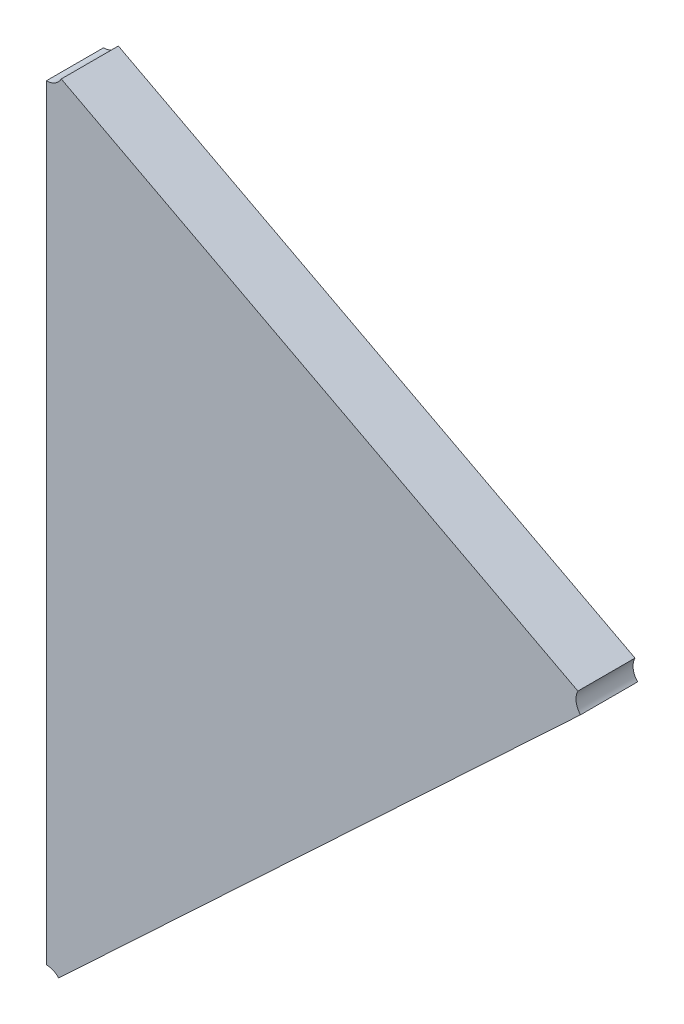
ISO-10303-21;
HEADER;
FILE_DESCRIPTION(('STEP AP214'),'2;1');
FILE_NAME('part.step','',(''),(''),'','','');
FILE_SCHEMA(('AUTOMOTIVE_DESIGN { 1 0 10303 214 1 1 1 1 }'));
ENDSEC;
DATA;
#1=APPLICATION_CONTEXT('core data for automotive mechanical design processes');
#2=APPLICATION_PROTOCOL_DEFINITION('international standard','automotive_design',2000,#1);
#3=PRODUCT_CONTEXT('',#1,'mechanical');
#4=PRODUCT('Part','Part','',(#3));
#5=PRODUCT_RELATED_PRODUCT_CATEGORY('part','',(#4));
#6=PRODUCT_DEFINITION_FORMATION('','',#4);
#7=PRODUCT_DEFINITION_CONTEXT('part definition',#1,'design');
#8=PRODUCT_DEFINITION('design','',#6,#7);
#9=PRODUCT_DEFINITION_SHAPE('','',#8);
#10=(LENGTH_UNIT() NAMED_UNIT(*) SI_UNIT(.MILLI.,.METRE.));
#11=(NAMED_UNIT(*) PLANE_ANGLE_UNIT() SI_UNIT($,.RADIAN.));
#12=(NAMED_UNIT(*) SI_UNIT($,.STERADIAN.) SOLID_ANGLE_UNIT());
#13=UNCERTAINTY_MEASURE_WITH_UNIT(LENGTH_MEASURE(1.E-05),#10,'distance_accuracy_value','');
#14=(GEOMETRIC_REPRESENTATION_CONTEXT(3) GLOBAL_UNCERTAINTY_ASSIGNED_CONTEXT((#13)) GLOBAL_UNIT_ASSIGNED_CONTEXT((#10,
#11,#12)) REPRESENTATION_CONTEXT('',''));
#15=CARTESIAN_POINT('',(0.,0.,0.));
#16=DIRECTION('',(0.,0.,1.));
#17=DIRECTION('',(1.,0.,0.));
#18=AXIS2_PLACEMENT_3D('',#15,#16,#17);
#19=CARTESIAN_POINT('',(-1.36524682085775,-1.28570071400538,0.0042));
#20=DIRECTION('',(0.,0.,1.));
#21=DIRECTION('',(1.,0.,0.));
#22=AXIS2_PLACEMENT_3D('',#19,#20,#21);
#23=PLANE('',#22);
#24=CARTESIAN_POINT('',(-1.37552796514819,-1.31090066755203,0.0042));
#25=DIRECTION('',(0.,0.,-1.));
#26=DIRECTION('',(0.,1.,0.));
#27=AXIS2_PLACEMENT_3D('',#24,#25,#26);
#28=CIRCLE('',#27,0.000999999999999994);
#29=CARTESIAN_POINT('',(-1.37552796514819,-1.30990066755203,0.0042));
#30=VERTEX_POINT('',#29);
#31=CARTESIAN_POINT('',(-1.37479814330141,-1.31021703016864,0.0042));
#32=VERTEX_POINT('',#31);
#33=EDGE_CURVE('E11',#30,#32,#28,.T.);
#34=ORIENTED_EDGE('',*,*,#33,.T.);
#35=DIRECTION('',(0.729821846781321,0.683637383384424,0.));
#36=VECTOR('',#35,1.);
#37=CARTESIAN_POINT('',(-1.37479814330141,-1.31021703016864,0.0042));
#38=LINE('',#37,#36);
#39=CARTESIAN_POINT('',(-1.34372317874952,-1.28110854629863,0.0042));
#40=VERTEX_POINT('',#39);
#41=EDGE_CURVE('E113',#32,#40,#38,.T.);
#42=ORIENTED_EDGE('',*,*,#41,.T.);
#43=CARTESIAN_POINT('',(-1.34299335690274,-1.28042490891524,0.0042));
#44=DIRECTION('',(0.,0.,-1.));
#45=DIRECTION('',(-0.72982184677793,-0.683637383388044,0.));
#46=AXIS2_PLACEMENT_3D('',#43,#44,#45);
#47=CIRCLE('',#46,0.00100000000000001);
#48=CARTESIAN_POINT('',(-1.34387839637048,-1.27995939292138,0.0042));
#49=VERTEX_POINT('',#48);
#50=EDGE_CURVE('E107',#40,#49,#47,.T.);
#51=ORIENTED_EDGE('',*,*,#50,.T.);
#52=DIRECTION('',(-0.88503946773786,0.465515993867328,0.));
#53=VECTOR('',#52,1.);
#54=CARTESIAN_POINT('',(-1.34387839637048,-1.27995939292138,0.0042));
#55=LINE('',#54,#53);
#56=CARTESIAN_POINT('',(-1.37464292568045,-1.26377776378545,0.0042));
#57=VERTEX_POINT('',#56);
#58=EDGE_CURVE('E70',#49,#57,#55,.T.);
#59=ORIENTED_EDGE('',*,*,#58,.T.);
#60=CARTESIAN_POINT('',(-1.37552796514819,-1.26331224779158,0.0042));
#61=DIRECTION('',(0.,0.,-1.));
#62=DIRECTION('',(0.885039467737278,-0.465515993868434,0.));
#63=AXIS2_PLACEMENT_3D('',#60,#61,#62);
#64=CIRCLE('',#63,0.00100000000000001);
#65=CARTESIAN_POINT('',(-1.37552796514819,-1.26431224779158,0.0042));
#66=VERTEX_POINT('',#65);
#67=EDGE_CURVE('E66',#57,#66,#64,.T.);
#68=ORIENTED_EDGE('',*,*,#67,.T.);
#69=DIRECTION('',(0.,-1.,0.));
#70=VECTOR('',#69,1.);
#71=CARTESIAN_POINT('',(-1.37552796514819,-1.26431224779158,0.0042));
#72=LINE('',#71,#70);
#73=EDGE_CURVE('E68',#66,#30,#72,.T.);
#74=ORIENTED_EDGE('',*,*,#73,.T.);
#75=EDGE_LOOP('',(#34,#42,#51,#59,#68,#74));
#76=FACE_BOUND('',#75,.T.);
#77=ADVANCED_FACE('F17',(#76),#23,.T.);
#78=CARTESIAN_POINT('',(-1.3652650664721,-1.28572023478097,0.0008));
#79=DIRECTION('',(0.,0.,-1.));
#80=DIRECTION('',(-1.,0.,0.));
#81=AXIS2_PLACEMENT_3D('',#78,#79,#80);
#82=PLANE('',#81);
#83=CARTESIAN_POINT('',(-1.37552796514819,-1.31090066755203,0.0008));
#84=DIRECTION('',(0.,0.,1.));
#85=DIRECTION('',(0.72982184677793,0.683637383388044,0.));
#86=AXIS2_PLACEMENT_3D('',#83,#84,#85);
#87=CIRCLE('',#86,0.000999999999999994);
#88=CARTESIAN_POINT('',(-1.37479814330141,-1.31021703016864,0.0008));
#89=VERTEX_POINT('',#88);
#90=CARTESIAN_POINT('',(-1.37552796514819,-1.30990066755203,0.0008));
#91=VERTEX_POINT('',#90);
#92=EDGE_CURVE('E24',#89,#91,#87,.T.);
#93=ORIENTED_EDGE('',*,*,#92,.T.);
#94=DIRECTION('',(0.,1.,0.));
#95=VECTOR('',#94,1.);
#96=CARTESIAN_POINT('',(-1.37552796514819,-1.30990066755203,0.0008));
#97=LINE('',#96,#95);
#98=CARTESIAN_POINT('',(-1.37552796514819,-1.26431224779158,0.0008));
#99=VERTEX_POINT('',#98);
#100=EDGE_CURVE('E109',#91,#99,#97,.T.);
#101=ORIENTED_EDGE('',*,*,#100,.T.);
#102=CARTESIAN_POINT('',(-1.37552796514819,-1.26331224779158,0.0008));
#103=DIRECTION('',(0.,0.,1.));
#104=DIRECTION('',(0.,-1.,0.));
#105=AXIS2_PLACEMENT_3D('',#102,#103,#104);
#106=CIRCLE('',#105,0.00100000000000001);
#107=CARTESIAN_POINT('',(-1.37464292568045,-1.26377776378545,0.0008));
#108=VERTEX_POINT('',#107);
#109=EDGE_CURVE('E88',#99,#108,#106,.T.);
#110=ORIENTED_EDGE('',*,*,#109,.T.);
#111=DIRECTION('',(0.885039467737862,-0.465515993867323,0.));
#112=VECTOR('',#111,1.);
#113=CARTESIAN_POINT('',(-1.37464292568045,-1.26377776378545,0.0008));
#114=LINE('',#113,#112);
#115=CARTESIAN_POINT('',(-1.34387839637048,-1.27995939292138,0.0008));
#116=VERTEX_POINT('',#115);
#117=EDGE_CURVE('E102',#108,#116,#114,.T.);
#118=ORIENTED_EDGE('',*,*,#117,.T.);
#119=CARTESIAN_POINT('',(-1.34299335690274,-1.28042490891524,0.0008));
#120=DIRECTION('',(0.,0.,1.));
#121=DIRECTION('',(-0.885039467741346,0.4655159938607,0.));
#122=AXIS2_PLACEMENT_3D('',#119,#120,#121);
#123=CIRCLE('',#122,0.00100000000000001);
#124=CARTESIAN_POINT('',(-1.34372317874952,-1.28110854629863,0.0008));
#125=VERTEX_POINT('',#124);
#126=EDGE_CURVE('E89',#116,#125,#123,.T.);
#127=ORIENTED_EDGE('',*,*,#126,.T.);
#128=DIRECTION('',(-0.729821846781323,-0.683637383384422,0.));
#129=VECTOR('',#128,1.);
#130=CARTESIAN_POINT('',(-1.34372317874952,-1.28110854629863,0.0008));
#131=LINE('',#130,#129);
#132=EDGE_CURVE('E97',#125,#89,#131,.T.);
#133=ORIENTED_EDGE('',*,*,#132,.T.);
#134=EDGE_LOOP('',(#93,#101,#110,#118,#127,#133));
#135=FACE_BOUND('',#134,.T.);
#136=ADVANCED_FACE('F125',(#135),#82,.T.);
#137=CARTESIAN_POINT('',(-1.37552796514819,-1.26331224779158,0.0008));
#138=DIRECTION('',(-0.465515993867324,-0.885039467737862,0.));
#139=DIRECTION('',(0.885039467737862,-0.465515993867324,0.));
#140=AXIS2_PLACEMENT_3D('',#137,#138,#139);
#141=PLANE('',#140);
#142=DIRECTION('',(0.,0.,-1.));
#143=VECTOR('',#142,1.);
#144=CARTESIAN_POINT('',(-1.34387839637048,-1.27995939292138,0.0042));
#145=LINE('',#144,#143);
#146=EDGE_CURVE('E111',#49,#116,#145,.T.);
#147=ORIENTED_EDGE('',*,*,#146,.T.);
#148=ORIENTED_EDGE('',*,*,#117,.F.);
#149=DIRECTION('',(0.,0.,1.));
#150=VECTOR('',#149,1.);
#151=CARTESIAN_POINT('',(-1.37464292568045,-1.26377776378545,0.0008));
#152=LINE('',#151,#150);
#153=EDGE_CURVE('E75',#108,#57,#152,.T.);
#154=ORIENTED_EDGE('',*,*,#153,.T.);
#155=ORIENTED_EDGE('',*,*,#58,.F.);
#156=EDGE_LOOP('',(#147,#148,#154,#155));
#157=FACE_BOUND('',#156,.T.);
#158=ADVANCED_FACE('F124',(#157),#141,.F.);
#159=CARTESIAN_POINT('',(-1.34299335690274,-1.28042490891524,0.0008));
#160=DIRECTION('',(-0.683637383384425,0.729821846781321,0.));
#161=DIRECTION('',(-0.729821846781321,-0.683637383384425,0.));
#162=AXIS2_PLACEMENT_3D('',#159,#160,#161);
#163=PLANE('',#162);
#164=DIRECTION('',(0.,0.,-1.));
#165=VECTOR('',#164,1.);
#166=CARTESIAN_POINT('',(-1.37479814330141,-1.31021703016864,0.0042));
#167=LINE('',#166,#165);
#168=EDGE_CURVE('E105',#32,#89,#167,.T.);
#169=ORIENTED_EDGE('',*,*,#168,.T.);
#170=ORIENTED_EDGE('',*,*,#132,.F.);
#171=DIRECTION('',(0.,0.,1.));
#172=VECTOR('',#171,1.);
#173=CARTESIAN_POINT('',(-1.34372317874952,-1.28110854629863,0.0008));
#174=LINE('',#173,#172);
#175=EDGE_CURVE('E83',#125,#40,#174,.T.);
#176=ORIENTED_EDGE('',*,*,#175,.T.);
#177=ORIENTED_EDGE('',*,*,#41,.F.);
#178=EDGE_LOOP('',(#169,#170,#176,#177));
#179=FACE_BOUND('',#178,.T.);
#180=ADVANCED_FACE('F118',(#179),#163,.F.);
#181=CARTESIAN_POINT('',(-1.37552796514819,-1.31090066755203,0.0008));
#182=DIRECTION('',(1.,0.,0.));
#183=DIRECTION('',(0.,1.,0.));
#184=AXIS2_PLACEMENT_3D('',#181,#182,#183);
#185=PLANE('',#184);
#186=DIRECTION('',(0.,0.,1.));
#187=VECTOR('',#186,1.);
#188=CARTESIAN_POINT('',(-1.37552796514819,-1.30990066755203,0.0008));
#189=LINE('',#188,#187);
#190=EDGE_CURVE('E82',#91,#30,#189,.T.);
#191=ORIENTED_EDGE('',*,*,#190,.T.);
#192=ORIENTED_EDGE('',*,*,#73,.F.);
#193=DIRECTION('',(0.,0.,1.));
#194=VECTOR('',#193,1.);
#195=CARTESIAN_POINT('',(-1.37552796514819,-1.26431224779158,0.0008));
#196=LINE('',#195,#194);
#197=EDGE_CURVE('E80',#99,#66,#196,.T.);
#198=ORIENTED_EDGE('',*,*,#197,.F.);
#199=ORIENTED_EDGE('',*,*,#100,.F.);
#200=EDGE_LOOP('',(#191,#192,#198,#199));
#201=FACE_BOUND('',#200,.T.);
#202=ADVANCED_FACE('F79',(#201),#185,.F.);
#203=CARTESIAN_POINT('',(-1.37552796514819,-1.26331224779158,0.0012));
#204=DIRECTION('',(0.,0.,1.));
#205=DIRECTION('',(-1.,0.,0.));
#206=AXIS2_PLACEMENT_3D('',#203,#204,#205);
#207=CYLINDRICAL_SURFACE('',#206,0.00100000000000001);
#208=ORIENTED_EDGE('',*,*,#153,.F.);
#209=ORIENTED_EDGE('',*,*,#109,.F.);
#210=ORIENTED_EDGE('',*,*,#197,.T.);
#211=ORIENTED_EDGE('',*,*,#67,.F.);
#212=EDGE_LOOP('',(#208,#209,#210,#211));
#213=FACE_BOUND('',#212,.T.);
#214=ADVANCED_FACE('F86',(#213),#207,.F.);
#215=CARTESIAN_POINT('',(-1.34299335690274,-1.28042490891524,0.0012));
#216=DIRECTION('',(0.,0.,1.));
#217=DIRECTION('',(-1.,0.,0.));
#218=AXIS2_PLACEMENT_3D('',#215,#216,#217);
#219=CYLINDRICAL_SURFACE('',#218,0.00100000000000001);
#220=ORIENTED_EDGE('',*,*,#146,.F.);
#221=ORIENTED_EDGE('',*,*,#50,.F.);
#222=ORIENTED_EDGE('',*,*,#175,.F.);
#223=ORIENTED_EDGE('',*,*,#126,.F.);
#224=EDGE_LOOP('',(#220,#221,#222,#223));
#225=FACE_BOUND('',#224,.T.);
#226=ADVANCED_FACE('F122',(#225),#219,.F.);
#227=CARTESIAN_POINT('',(-1.37552796514819,-1.31090066755203,0.0012));
#228=DIRECTION('',(0.,0.,1.));
#229=DIRECTION('',(-1.,0.,0.));
#230=AXIS2_PLACEMENT_3D('',#227,#228,#229);
#231=CYLINDRICAL_SURFACE('',#230,0.000999999999999994);
#232=ORIENTED_EDGE('',*,*,#168,.F.);
#233=ORIENTED_EDGE('',*,*,#33,.F.);
#234=ORIENTED_EDGE('',*,*,#190,.F.);
#235=ORIENTED_EDGE('',*,*,#92,.F.);
#236=EDGE_LOOP('',(#232,#233,#234,#235));
#237=FACE_BOUND('',#236,.T.);
#238=ADVANCED_FACE('F127',(#237),#231,.F.);
#239=CLOSED_SHELL('',(#77,#136,#158,#180,#202,#214,#226,#238));
#240=MANIFOLD_SOLID_BREP('B1',#239);
#241=ADVANCED_BREP_SHAPE_REPRESENTATION('',(#18,#240),#14);
#242=SHAPE_DEFINITION_REPRESENTATION(#9,#241);
ENDSEC;
END-ISO-10303-21;
